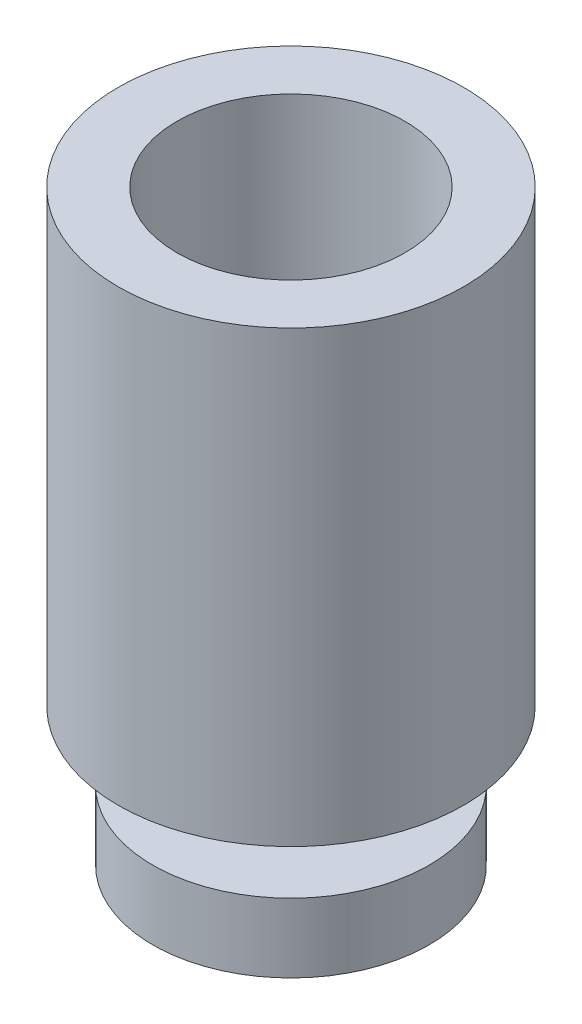
ISO-10303-21;
HEADER;
FILE_DESCRIPTION(('STEP AP214'),'2;1');
FILE_NAME('part.step','',(''),(''),'','','');
FILE_SCHEMA(('AUTOMOTIVE_DESIGN { 1 0 10303 214 1 1 1 1 }'));
ENDSEC;
DATA;
#1=APPLICATION_CONTEXT('core data for automotive mechanical design processes');
#2=APPLICATION_PROTOCOL_DEFINITION('international standard','automotive_design',2000,#1);
#3=PRODUCT_CONTEXT('',#1,'mechanical');
#4=PRODUCT('Part','Part','',(#3));
#5=PRODUCT_RELATED_PRODUCT_CATEGORY('part','',(#4));
#6=PRODUCT_DEFINITION_FORMATION('','',#4);
#7=PRODUCT_DEFINITION_CONTEXT('part definition',#1,'design');
#8=PRODUCT_DEFINITION('design','',#6,#7);
#9=PRODUCT_DEFINITION_SHAPE('','',#8);
#10=(LENGTH_UNIT() NAMED_UNIT(*) SI_UNIT(.MILLI.,.METRE.));
#11=(NAMED_UNIT(*) PLANE_ANGLE_UNIT() SI_UNIT($,.RADIAN.));
#12=(NAMED_UNIT(*) SI_UNIT($,.STERADIAN.) SOLID_ANGLE_UNIT());
#13=UNCERTAINTY_MEASURE_WITH_UNIT(LENGTH_MEASURE(1.E-05),#10,'distance_accuracy_value','');
#14=(GEOMETRIC_REPRESENTATION_CONTEXT(3) GLOBAL_UNCERTAINTY_ASSIGNED_CONTEXT((#13)) GLOBAL_UNIT_ASSIGNED_CONTEXT((#10,
#11,#12)) REPRESENTATION_CONTEXT('',''));
#15=CARTESIAN_POINT('',(0.,0.,0.));
#16=DIRECTION('',(0.,0.,1.));
#17=DIRECTION('',(1.,0.,0.));
#18=AXIS2_PLACEMENT_3D('',#15,#16,#17);
#19=CARTESIAN_POINT('',(-0.522013311509166,6.5,-0.51113803418606));
#20=DIRECTION('',(0.,-1.,0.));
#21=DIRECTION('',(0.,0.,-1.));
#22=AXIS2_PLACEMENT_3D('',#19,#20,#21);
#23=CYLINDRICAL_SURFACE('',#22,2.5);
#24=CARTESIAN_POINT('',(-0.522013311509166,6.5,-0.51113803418606));
#25=DIRECTION('',(0.,1.,0.));
#26=DIRECTION('',(0.,0.,1.));
#27=AXIS2_PLACEMENT_3D('',#24,#25,#26);
#28=CIRCLE('',#27,2.5);
#29=CARTESIAN_POINT('',(-0.522013311509166,6.5,1.98886196581394));
#30=VERTEX_POINT('',#29);
#31=EDGE_CURVE('E53',#30,#30,#28,.T.);
#32=ORIENTED_EDGE('',*,*,#31,.F.);
#33=EDGE_LOOP('',(#32));
#34=FACE_BOUND('',#33,.T.);
#35=CARTESIAN_POINT('',(-0.522013311509166,0.,-0.51113803418606));
#36=DIRECTION('',(0.,1.,0.));
#37=DIRECTION('',(0.,0.,1.));
#38=AXIS2_PLACEMENT_3D('',#35,#36,#37);
#39=CIRCLE('',#38,2.5);
#40=CARTESIAN_POINT('',(-0.522013311509166,0.,1.98886196581394));
#41=VERTEX_POINT('',#40);
#42=EDGE_CURVE('E48',#41,#41,#39,.T.);
#43=ORIENTED_EDGE('',*,*,#42,.T.);
#44=EDGE_LOOP('',(#43));
#45=FACE_BOUND('',#44,.T.);
#46=ADVANCED_FACE('F45',(#34,#45),#23,.T.);
#47=CARTESIAN_POINT('',(-0.522013311509166,6.5,-0.51113803418606));
#48=DIRECTION('',(0.,1.,0.));
#49=DIRECTION('',(0.,0.,1.));
#50=AXIS2_PLACEMENT_3D('',#47,#48,#49);
#51=PLANE('',#50);
#52=CARTESIAN_POINT('',(-0.522013311509166,6.5,-0.51113803418606));
#53=DIRECTION('',(0.,1.,0.));
#54=DIRECTION('',(0.,0.,1.));
#55=AXIS2_PLACEMENT_3D('',#52,#53,#54);
#56=CIRCLE('',#55,1.65);
#57=CARTESIAN_POINT('',(-0.522013311509166,6.5,1.13886196581394));
#58=VERTEX_POINT('',#57);
#59=EDGE_CURVE('E73',#58,#58,#56,.T.);
#60=ORIENTED_EDGE('',*,*,#59,.F.);
#61=EDGE_LOOP('',(#60));
#62=FACE_BOUND('',#61,.T.);
#63=ORIENTED_EDGE('',*,*,#31,.T.);
#64=EDGE_LOOP('',(#63));
#65=FACE_BOUND('',#64,.T.);
#66=ADVANCED_FACE('F90',(#62,#65),#51,.T.);
#67=CARTESIAN_POINT('',(-0.522013311509166,0.,-0.51113803418606));
#68=DIRECTION('',(0.,1.,0.));
#69=DIRECTION('',(0.,0.,1.));
#70=AXIS2_PLACEMENT_3D('',#67,#68,#69);
#71=PLANE('',#70);
#72=CARTESIAN_POINT('',(-0.522013311509166,0.,-0.51113803418606));
#73=DIRECTION('',(0.,-1.,0.));
#74=DIRECTION('',(0.,0.,-1.));
#75=AXIS2_PLACEMENT_3D('',#72,#73,#74);
#76=CIRCLE('',#75,1.);
#77=CARTESIAN_POINT('',(-0.522013311509166,0.,-1.51113803418606));
#78=VERTEX_POINT('',#77);
#79=EDGE_CURVE('E10',#78,#78,#76,.T.);
#80=ORIENTED_EDGE('',*,*,#79,.F.);
#81=EDGE_LOOP('',(#80));
#82=FACE_BOUND('',#81,.T.);
#83=ORIENTED_EDGE('',*,*,#42,.F.);
#84=EDGE_LOOP('',(#83));
#85=FACE_BOUND('',#84,.T.);
#86=ADVANCED_FACE('F93',(#82,#85),#71,.F.);
#87=CARTESIAN_POINT('',(-0.522013311509166,-1.,-0.51113803418606));
#88=DIRECTION('',(0.,1.,0.));
#89=DIRECTION('',(0.,0.,1.));
#90=AXIS2_PLACEMENT_3D('',#87,#88,#89);
#91=CYLINDRICAL_SURFACE('',#90,1.);
#92=CARTESIAN_POINT('',(-0.522013311509166,-1.,-0.51113803418606));
#93=DIRECTION('',(0.,-1.,0.));
#94=DIRECTION('',(0.,0.,-1.));
#95=AXIS2_PLACEMENT_3D('',#92,#93,#94);
#96=CIRCLE('',#95,1.);
#97=CARTESIAN_POINT('',(-0.522013311509166,-1.,-1.51113803418606));
#98=VERTEX_POINT('',#97);
#99=EDGE_CURVE('E60',#98,#98,#96,.T.);
#100=ORIENTED_EDGE('',*,*,#99,.F.);
#101=EDGE_LOOP('',(#100));
#102=FACE_BOUND('',#101,.T.);
#103=ORIENTED_EDGE('',*,*,#79,.T.);
#104=EDGE_LOOP('',(#103));
#105=FACE_BOUND('',#104,.T.);
#106=ADVANCED_FACE('F104',(#102,#105),#91,.T.);
#107=CARTESIAN_POINT('',(-0.522013311509166,-2.,-0.51113803418606));
#108=DIRECTION('',(0.,1.,0.));
#109=DIRECTION('',(0.,0.,1.));
#110=AXIS2_PLACEMENT_3D('',#107,#108,#109);
#111=CYLINDRICAL_SURFACE('',#110,2.);
#112=CARTESIAN_POINT('',(-0.522013311509166,-2.,-0.51113803418606));
#113=DIRECTION('',(0.,-1.,0.));
#114=DIRECTION('',(0.,0.,-1.));
#115=AXIS2_PLACEMENT_3D('',#112,#113,#114);
#116=CIRCLE('',#115,2.);
#117=CARTESIAN_POINT('',(-0.522013311509166,-2.,-2.51113803418606));
#118=VERTEX_POINT('',#117);
#119=EDGE_CURVE('E64',#118,#118,#116,.T.);
#120=ORIENTED_EDGE('',*,*,#119,.F.);
#121=EDGE_LOOP('',(#120));
#122=FACE_BOUND('',#121,.T.);
#123=CARTESIAN_POINT('',(-0.522013311509166,-1.,-0.51113803418606));
#124=DIRECTION('',(0.,-1.,0.));
#125=DIRECTION('',(0.,0.,-1.));
#126=AXIS2_PLACEMENT_3D('',#123,#124,#125);
#127=CIRCLE('',#126,2.);
#128=CARTESIAN_POINT('',(-0.522013311509166,-1.,-2.51113803418606));
#129=VERTEX_POINT('',#128);
#130=EDGE_CURVE('E65',#129,#129,#127,.T.);
#131=ORIENTED_EDGE('',*,*,#130,.T.);
#132=EDGE_LOOP('',(#131));
#133=FACE_BOUND('',#132,.T.);
#134=ADVANCED_FACE('F109',(#122,#133),#111,.T.);
#135=CARTESIAN_POINT('',(-0.522013311509166,-2.,-0.51113803418606));
#136=DIRECTION('',(0.,-1.,0.));
#137=DIRECTION('',(0.,0.,-1.));
#138=AXIS2_PLACEMENT_3D('',#135,#136,#137);
#139=PLANE('',#138);
#140=ORIENTED_EDGE('',*,*,#119,.T.);
#141=EDGE_LOOP('',(#140));
#142=FACE_BOUND('',#141,.T.);
#143=ADVANCED_FACE('F115',(#142),#139,.T.);
#144=CARTESIAN_POINT('',(-0.522013311509166,-1.,-0.51113803418606));
#145=DIRECTION('',(0.,-1.,0.));
#146=DIRECTION('',(0.,0.,-1.));
#147=AXIS2_PLACEMENT_3D('',#144,#145,#146);
#148=PLANE('',#147);
#149=ORIENTED_EDGE('',*,*,#99,.T.);
#150=EDGE_LOOP('',(#149));
#151=FACE_BOUND('',#150,.T.);
#152=ORIENTED_EDGE('',*,*,#130,.F.);
#153=EDGE_LOOP('',(#152));
#154=FACE_BOUND('',#153,.T.);
#155=ADVANCED_FACE('F86',(#151,#154),#148,.F.);
#156=CARTESIAN_POINT('',(-0.522013311509166,1.5,-0.51113803418606));
#157=DIRECTION('',(0.,1.,0.));
#158=DIRECTION('',(0.,0.,1.));
#159=AXIS2_PLACEMENT_3D('',#156,#157,#158);
#160=CYLINDRICAL_SURFACE('',#159,1.65);
#161=CARTESIAN_POINT('',(-0.522013311509166,1.5,-0.51113803418606));
#162=DIRECTION('',(0.,1.,0.));
#163=DIRECTION('',(0.,0.,1.));
#164=AXIS2_PLACEMENT_3D('',#161,#162,#163);
#165=CIRCLE('',#164,1.65);
#166=CARTESIAN_POINT('',(-0.522013311509166,1.5,1.13886196581394));
#167=VERTEX_POINT('',#166);
#168=EDGE_CURVE('E69',#167,#167,#165,.T.);
#169=ORIENTED_EDGE('',*,*,#168,.F.);
#170=EDGE_LOOP('',(#169));
#171=FACE_BOUND('',#170,.T.);
#172=ORIENTED_EDGE('',*,*,#59,.T.);
#173=EDGE_LOOP('',(#172));
#174=FACE_BOUND('',#173,.T.);
#175=ADVANCED_FACE('F83',(#171,#174),#160,.F.);
#176=CARTESIAN_POINT('',(-0.522013311509166,1.5,-0.51113803418606));
#177=DIRECTION('',(0.,1.,0.));
#178=DIRECTION('',(0.,0.,1.));
#179=AXIS2_PLACEMENT_3D('',#176,#177,#178);
#180=PLANE('',#179);
#181=ORIENTED_EDGE('',*,*,#168,.T.);
#182=EDGE_LOOP('',(#181));
#183=FACE_BOUND('',#182,.T.);
#184=ADVANCED_FACE('F81',(#183),#180,.T.);
#185=CLOSED_SHELL('',(#46,#66,#86,#106,#134,#143,#155,#175,#184));
#186=MANIFOLD_SOLID_BREP('B2',#185);
#187=ADVANCED_BREP_SHAPE_REPRESENTATION('',(#18,#186),#14);
#188=SHAPE_DEFINITION_REPRESENTATION(#9,#187);
ENDSEC;
END-ISO-10303-21;
